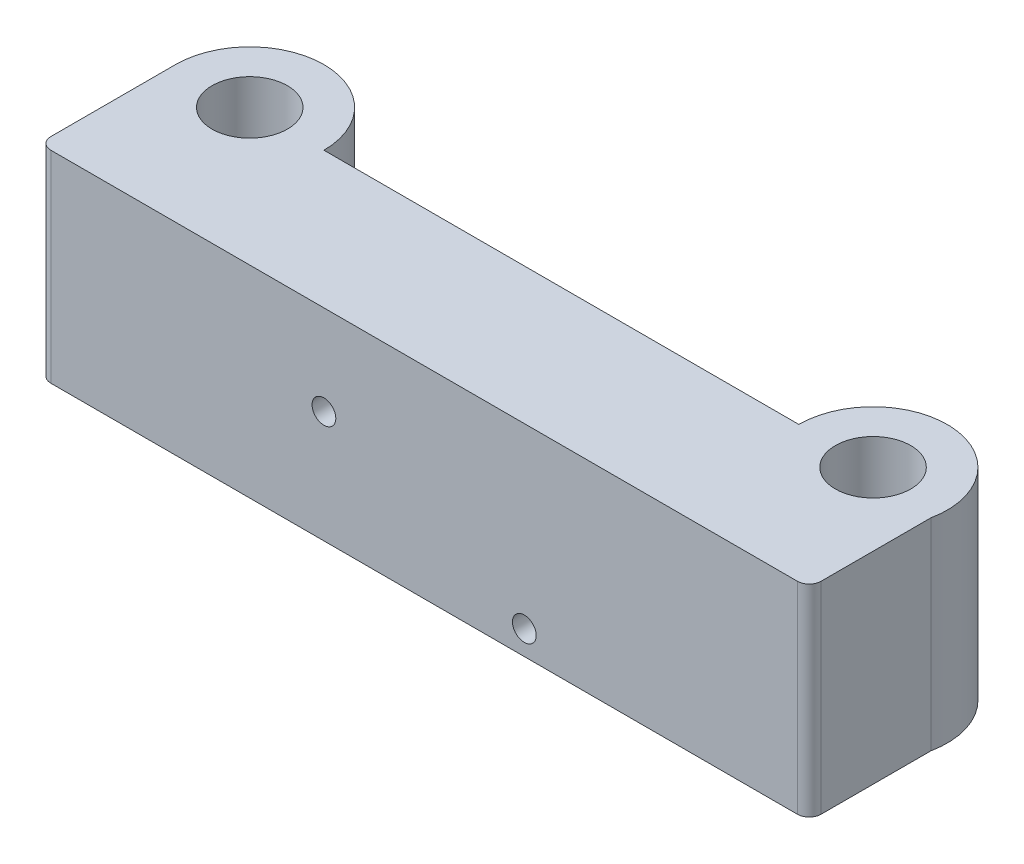
ISO-10303-21;
HEADER;
FILE_DESCRIPTION(('STEP AP214'),'2;1');
FILE_NAME('part.step','',(''),(''),'','','');
FILE_SCHEMA(('AUTOMOTIVE_DESIGN { 1 0 10303 214 1 1 1 1 }'));
ENDSEC;
DATA;
#1=APPLICATION_CONTEXT('core data for automotive mechanical design processes');
#2=APPLICATION_PROTOCOL_DEFINITION('international standard','automotive_design',2000,#1);
#3=PRODUCT_CONTEXT('',#1,'mechanical');
#4=PRODUCT('Part','Part','',(#3));
#5=PRODUCT_RELATED_PRODUCT_CATEGORY('part','',(#4));
#6=PRODUCT_DEFINITION_FORMATION('','',#4);
#7=PRODUCT_DEFINITION_CONTEXT('part definition',#1,'design');
#8=PRODUCT_DEFINITION('design','',#6,#7);
#9=PRODUCT_DEFINITION_SHAPE('','',#8);
#10=(LENGTH_UNIT() NAMED_UNIT(*) SI_UNIT(.MILLI.,.METRE.));
#11=(NAMED_UNIT(*) PLANE_ANGLE_UNIT() SI_UNIT($,.RADIAN.));
#12=(NAMED_UNIT(*) SI_UNIT($,.STERADIAN.) SOLID_ANGLE_UNIT());
#13=UNCERTAINTY_MEASURE_WITH_UNIT(LENGTH_MEASURE(1.E-05),#10,'distance_accuracy_value','');
#14=(GEOMETRIC_REPRESENTATION_CONTEXT(3) GLOBAL_UNCERTAINTY_ASSIGNED_CONTEXT((#13)) GLOBAL_UNIT_ASSIGNED_CONTEXT((#10,
#11,#12)) REPRESENTATION_CONTEXT('',''));
#15=CARTESIAN_POINT('',(0.,0.,0.));
#16=DIRECTION('',(0.,0.,1.));
#17=DIRECTION('',(1.,0.,0.));
#18=AXIS2_PLACEMENT_3D('',#15,#16,#17);
#19=CARTESIAN_POINT('',(-31.235807588018,17.,0.));
#20=DIRECTION('',(0.,-1.,0.));
#21=DIRECTION('',(0.,0.,-1.));
#22=AXIS2_PLACEMENT_3D('',#19,#20,#21);
#23=CYLINDRICAL_SURFACE('',#22,6.25);
#24=CARTESIAN_POINT('',(-31.235807588018,0.,0.));
#25=DIRECTION('',(0.,1.,0.));
#26=DIRECTION('',(0.,0.,1.));
#27=AXIS2_PLACEMENT_3D('',#24,#25,#26);
#28=CIRCLE('',#27,6.25);
#29=CARTESIAN_POINT('',(-24.985807588018,0.,0.));
#30=VERTEX_POINT('',#29);
#31=CARTESIAN_POINT('',(-37.485807588018,0.,0.));
#32=VERTEX_POINT('',#31);
#33=EDGE_CURVE('E126',#30,#32,#28,.T.);
#34=ORIENTED_EDGE('',*,*,#33,.T.);
#35=DIRECTION('',(0.,-1.,0.));
#36=VECTOR('',#35,1.);
#37=CARTESIAN_POINT('',(-37.485807588018,17.,0.));
#38=LINE('',#37,#36);
#39=CARTESIAN_POINT('',(-37.485807588018,17.,0.));
#40=VERTEX_POINT('',#39);
#41=EDGE_CURVE('E107',#40,#32,#38,.T.);
#42=ORIENTED_EDGE('',*,*,#41,.F.);
#43=CARTESIAN_POINT('',(-31.235807588018,17.,0.));
#44=DIRECTION('',(0.,1.,0.));
#45=DIRECTION('',(0.,0.,1.));
#46=AXIS2_PLACEMENT_3D('',#43,#44,#45);
#47=CIRCLE('',#46,6.25);
#48=CARTESIAN_POINT('',(-24.985807588018,17.,0.));
#49=VERTEX_POINT('',#48);
#50=EDGE_CURVE('E113',#49,#40,#47,.T.);
#51=ORIENTED_EDGE('',*,*,#50,.F.);
#52=DIRECTION('',(0.,-1.,0.));
#53=VECTOR('',#52,1.);
#54=CARTESIAN_POINT('',(-24.985807588018,17.,0.));
#55=LINE('',#54,#53);
#56=EDGE_CURVE('E201',#49,#30,#55,.T.);
#57=ORIENTED_EDGE('',*,*,#56,.T.);
#58=EDGE_LOOP('',(#34,#42,#51,#57));
#59=FACE_BOUND('',#58,.T.);
#60=ADVANCED_FACE('F38',(#59),#23,.T.);
#61=CARTESIAN_POINT('',(-37.485807588018,17.,0.));
#62=DIRECTION('',(1.,0.,0.));
#63=DIRECTION('',(0.,0.,-1.));
#64=AXIS2_PLACEMENT_3D('',#61,#62,#63);
#65=PLANE('',#64);
#66=DIRECTION('',(0.,0.,1.));
#67=VECTOR('',#66,1.);
#68=CARTESIAN_POINT('',(-37.485807588018,0.,0.));
#69=LINE('',#68,#67);
#70=CARTESIAN_POINT('',(-37.485807588018,0.,10.5));
#71=VERTEX_POINT('',#70);
#72=EDGE_CURVE('E188',#32,#71,#69,.T.);
#73=ORIENTED_EDGE('',*,*,#72,.T.);
#74=DIRECTION('',(0.,-1.,0.));
#75=VECTOR('',#74,1.);
#76=CARTESIAN_POINT('',(-37.485807588018,17.,10.5));
#77=LINE('',#76,#75);
#78=CARTESIAN_POINT('',(-37.485807588018,17.,10.5));
#79=VERTEX_POINT('',#78);
#80=EDGE_CURVE('E11',#71,#79,#77,.F.);
#81=ORIENTED_EDGE('',*,*,#80,.T.);
#82=DIRECTION('',(0.,0.,1.));
#83=VECTOR('',#82,1.);
#84=CARTESIAN_POINT('',(-37.485807588018,17.,0.));
#85=LINE('',#84,#83);
#86=EDGE_CURVE('E103',#40,#79,#85,.T.);
#87=ORIENTED_EDGE('',*,*,#86,.F.);
#88=ORIENTED_EDGE('',*,*,#41,.T.);
#89=EDGE_LOOP('',(#73,#81,#87,#88));
#90=FACE_BOUND('',#89,.T.);
#91=ADVANCED_FACE('F105',(#90),#65,.F.);
#92=CARTESIAN_POINT('',(-37.485807588018,17.,11.5));
#93=DIRECTION('',(0.,0.,-1.));
#94=DIRECTION('',(-1.,0.,0.));
#95=AXIS2_PLACEMENT_3D('',#92,#93,#94);
#96=PLANE('',#95);
#97=CARTESIAN_POINT('',(-13.485807588018,9.437,11.5));
#98=DIRECTION('',(0.,0.,1.));
#99=DIRECTION('',(1.,0.,0.));
#100=AXIS2_PLACEMENT_3D('',#97,#98,#99);
#101=CIRCLE('',#100,1.);
#102=CARTESIAN_POINT('',(-12.485807588018,9.437,11.5));
#103=VERTEX_POINT('',#102);
#104=EDGE_CURVE('E146',#103,#103,#101,.T.);
#105=ORIENTED_EDGE('',*,*,#104,.F.);
#106=EDGE_LOOP('',(#105));
#107=FACE_BOUND('',#106,.T.);
#108=CARTESIAN_POINT('',(3.39419241198202,2.037,11.5));
#109=DIRECTION('',(0.,0.,1.));
#110=DIRECTION('',(1.,0.,0.));
#111=AXIS2_PLACEMENT_3D('',#108,#109,#110);
#112=CIRCLE('',#111,1.);
#113=CARTESIAN_POINT('',(4.39419241198202,2.037,11.5));
#114=VERTEX_POINT('',#113);
#115=EDGE_CURVE('E233',#114,#114,#112,.T.);
#116=ORIENTED_EDGE('',*,*,#115,.F.);
#117=EDGE_LOOP('',(#116));
#118=FACE_BOUND('',#117,.T.);
#119=DIRECTION('',(1.,0.,0.));
#120=VECTOR('',#119,1.);
#121=CARTESIAN_POINT('',(-37.485807588018,0.,11.5));
#122=LINE('',#121,#120);
#123=CARTESIAN_POINT('',(-36.485807588018,0.,11.5));
#124=VERTEX_POINT('',#123);
#125=CARTESIAN_POINT('',(26.394192411982,0.,11.5));
#126=VERTEX_POINT('',#125);
#127=EDGE_CURVE('E182',#124,#126,#122,.T.);
#128=ORIENTED_EDGE('',*,*,#127,.T.);
#129=DIRECTION('',(0.,-1.,0.));
#130=VECTOR('',#129,1.);
#131=CARTESIAN_POINT('',(26.394192411982,17.,11.5));
#132=LINE('',#131,#130);
#133=CARTESIAN_POINT('',(26.394192411982,17.,11.5));
#134=VERTEX_POINT('',#133);
#135=EDGE_CURVE('E60',#126,#134,#132,.F.);
#136=ORIENTED_EDGE('',*,*,#135,.T.);
#137=DIRECTION('',(1.,0.,0.));
#138=VECTOR('',#137,1.);
#139=CARTESIAN_POINT('',(-37.485807588018,17.,11.5));
#140=LINE('',#139,#138);
#141=CARTESIAN_POINT('',(-36.485807588018,17.,11.5));
#142=VERTEX_POINT('',#141);
#143=EDGE_CURVE('E112',#142,#134,#140,.T.);
#144=ORIENTED_EDGE('',*,*,#143,.F.);
#145=DIRECTION('',(0.,-1.,0.));
#146=VECTOR('',#145,1.);
#147=CARTESIAN_POINT('',(-36.485807588018,17.,11.5));
#148=LINE('',#147,#146);
#149=EDGE_CURVE('E156',#142,#124,#148,.T.);
#150=ORIENTED_EDGE('',*,*,#149,.T.);
#151=EDGE_LOOP('',(#128,#136,#144,#150));
#152=FACE_BOUND('',#151,.T.);
#153=ADVANCED_FACE('F185',(#107,#118,#152),#96,.F.);
#154=CARTESIAN_POINT('',(27.394192411982,17.,1.25));
#155=DIRECTION('',(-1.,0.,0.));
#156=DIRECTION('',(0.,0.,1.));
#157=AXIS2_PLACEMENT_3D('',#154,#155,#156);
#158=PLANE('',#157);
#159=DIRECTION('',(0.,0.,-1.));
#160=VECTOR('',#159,1.);
#161=CARTESIAN_POINT('',(27.394192411982,17.,1.25));
#162=LINE('',#161,#160);
#163=CARTESIAN_POINT('',(27.394192411982,17.,10.5));
#164=VERTEX_POINT('',#163);
#165=CARTESIAN_POINT('',(27.394192411982,17.,1.25));
#166=VERTEX_POINT('',#165);
#167=EDGE_CURVE('E167',#164,#166,#162,.T.);
#168=ORIENTED_EDGE('',*,*,#167,.F.);
#169=DIRECTION('',(0.,-1.,0.));
#170=VECTOR('',#169,1.);
#171=CARTESIAN_POINT('',(27.394192411982,17.,10.5));
#172=LINE('',#171,#170);
#173=CARTESIAN_POINT('',(27.394192411982,0.,10.5));
#174=VERTEX_POINT('',#173);
#175=EDGE_CURVE('E128',#164,#174,#172,.T.);
#176=ORIENTED_EDGE('',*,*,#175,.T.);
#177=DIRECTION('',(0.,0.,-1.));
#178=VECTOR('',#177,1.);
#179=CARTESIAN_POINT('',(27.394192411982,0.,1.25));
#180=LINE('',#179,#178);
#181=CARTESIAN_POINT('',(27.394192411982,0.,1.25));
#182=VERTEX_POINT('',#181);
#183=EDGE_CURVE('E184',#174,#182,#180,.T.);
#184=ORIENTED_EDGE('',*,*,#183,.T.);
#185=DIRECTION('',(0.,-1.,0.));
#186=VECTOR('',#185,1.);
#187=CARTESIAN_POINT('',(27.394192411982,17.,1.25));
#188=LINE('',#187,#186);
#189=EDGE_CURVE('E129',#166,#182,#188,.T.);
#190=ORIENTED_EDGE('',*,*,#189,.F.);
#191=EDGE_LOOP('',(#168,#176,#184,#190));
#192=FACE_BOUND('',#191,.T.);
#193=ADVANCED_FACE('F172',(#192),#158,.F.);
#194=CARTESIAN_POINT('',(21.2704680550241,17.,0.));
#195=DIRECTION('',(0.,-1.,0.));
#196=DIRECTION('',(0.,0.,-1.));
#197=AXIS2_PLACEMENT_3D('',#194,#195,#196);
#198=CYLINDRICAL_SURFACE('',#197,6.25);
#199=CARTESIAN_POINT('',(21.2704680550241,0.,0.));
#200=DIRECTION('',(0.,1.,0.));
#201=DIRECTION('',(0.,0.,1.));
#202=AXIS2_PLACEMENT_3D('',#199,#200,#201);
#203=CIRCLE('',#202,6.25);
#204=CARTESIAN_POINT('',(15.0204680550241,0.,0.));
#205=VERTEX_POINT('',#204);
#206=EDGE_CURVE('E192',#182,#205,#203,.T.);
#207=ORIENTED_EDGE('',*,*,#206,.T.);
#208=DIRECTION('',(0.,-1.,0.));
#209=VECTOR('',#208,1.);
#210=CARTESIAN_POINT('',(15.0204680550241,17.,0.));
#211=LINE('',#210,#209);
#212=CARTESIAN_POINT('',(15.0204680550241,17.,0.));
#213=VERTEX_POINT('',#212);
#214=EDGE_CURVE('E137',#213,#205,#211,.T.);
#215=ORIENTED_EDGE('',*,*,#214,.F.);
#216=CARTESIAN_POINT('',(21.2704680550241,17.,0.));
#217=DIRECTION('',(0.,1.,0.));
#218=DIRECTION('',(0.,0.,1.));
#219=AXIS2_PLACEMENT_3D('',#216,#217,#218);
#220=CIRCLE('',#219,6.25);
#221=EDGE_CURVE('E176',#166,#213,#220,.T.);
#222=ORIENTED_EDGE('',*,*,#221,.F.);
#223=ORIENTED_EDGE('',*,*,#189,.T.);
#224=EDGE_LOOP('',(#207,#215,#222,#223));
#225=FACE_BOUND('',#224,.T.);
#226=ADVANCED_FACE('F257',(#225),#198,.T.);
#227=CARTESIAN_POINT('',(-24.985807588018,17.,0.));
#228=DIRECTION('',(0.,0.,1.));
#229=DIRECTION('',(1.,0.,0.));
#230=AXIS2_PLACEMENT_3D('',#227,#228,#229);
#231=PLANE('',#230);
#232=CARTESIAN_POINT('',(-13.485807588018,9.437,0.));
#233=DIRECTION('',(0.,0.,1.));
#234=DIRECTION('',(1.,0.,0.));
#235=AXIS2_PLACEMENT_3D('',#232,#233,#234);
#236=CIRCLE('',#235,1.);
#237=CARTESIAN_POINT('',(-12.485807588018,9.437,0.));
#238=VERTEX_POINT('',#237);
#239=EDGE_CURVE('E145',#238,#238,#236,.T.);
#240=ORIENTED_EDGE('',*,*,#239,.T.);
#241=EDGE_LOOP('',(#240));
#242=FACE_BOUND('',#241,.T.);
#243=CARTESIAN_POINT('',(3.39419241198202,2.037,0.));
#244=DIRECTION('',(0.,0.,1.));
#245=DIRECTION('',(1.,0.,0.));
#246=AXIS2_PLACEMENT_3D('',#243,#244,#245);
#247=CIRCLE('',#246,1.);
#248=CARTESIAN_POINT('',(4.39419241198202,2.037,0.));
#249=VERTEX_POINT('',#248);
#250=EDGE_CURVE('E141',#249,#249,#247,.T.);
#251=ORIENTED_EDGE('',*,*,#250,.T.);
#252=EDGE_LOOP('',(#251));
#253=FACE_BOUND('',#252,.T.);
#254=DIRECTION('',(-1.,0.,0.));
#255=VECTOR('',#254,1.);
#256=CARTESIAN_POINT('',(-24.985807588018,0.,0.));
#257=LINE('',#256,#255);
#258=EDGE_CURVE('E123',#205,#30,#257,.T.);
#259=ORIENTED_EDGE('',*,*,#258,.T.);
#260=ORIENTED_EDGE('',*,*,#56,.F.);
#261=DIRECTION('',(-1.,0.,0.));
#262=VECTOR('',#261,1.);
#263=CARTESIAN_POINT('',(-24.985807588018,17.,0.));
#264=LINE('',#263,#262);
#265=EDGE_CURVE('E118',#213,#49,#264,.T.);
#266=ORIENTED_EDGE('',*,*,#265,.F.);
#267=ORIENTED_EDGE('',*,*,#214,.T.);
#268=EDGE_LOOP('',(#259,#260,#266,#267));
#269=FACE_BOUND('',#268,.T.);
#270=ADVANCED_FACE('F208',(#242,#253,#269),#231,.F.);
#271=CARTESIAN_POINT('',(-31.235807588018,17.,0.));
#272=DIRECTION('',(0.,1.,0.));
#273=DIRECTION('',(0.,0.,1.));
#274=AXIS2_PLACEMENT_3D('',#271,#272,#273);
#275=PLANE('',#274);
#276=CARTESIAN_POINT('',(-31.235807588018,17.,0.));
#277=DIRECTION('',(0.,1.,0.));
#278=DIRECTION('',(0.,0.,1.));
#279=AXIS2_PLACEMENT_3D('',#276,#277,#278);
#280=CIRCLE('',#279,3.175);
#281=CARTESIAN_POINT('',(-31.235807588018,17.,3.175));
#282=VERTEX_POINT('',#281);
#283=EDGE_CURVE('E214',#282,#282,#280,.T.);
#284=ORIENTED_EDGE('',*,*,#283,.F.);
#285=EDGE_LOOP('',(#284));
#286=FACE_BOUND('',#285,.T.);
#287=CARTESIAN_POINT('',(21.2704680550241,17.,0.));
#288=DIRECTION('',(0.,1.,0.));
#289=DIRECTION('',(0.,0.,1.));
#290=AXIS2_PLACEMENT_3D('',#287,#288,#289);
#291=CIRCLE('',#290,3.175);
#292=CARTESIAN_POINT('',(21.2704680550241,17.,3.175));
#293=VERTEX_POINT('',#292);
#294=EDGE_CURVE('E149',#293,#293,#291,.T.);
#295=ORIENTED_EDGE('',*,*,#294,.F.);
#296=EDGE_LOOP('',(#295));
#297=FACE_BOUND('',#296,.T.);
#298=ORIENTED_EDGE('',*,*,#143,.T.);
#299=CARTESIAN_POINT('',(26.394192411982,17.,10.5));
#300=DIRECTION('',(0.,1.,0.));
#301=DIRECTION('',(0.,0.,1.));
#302=AXIS2_PLACEMENT_3D('',#299,#300,#301);
#303=CIRCLE('',#302,1.);
#304=EDGE_CURVE('E47',#134,#164,#303,.T.);
#305=ORIENTED_EDGE('',*,*,#304,.T.);
#306=ORIENTED_EDGE('',*,*,#167,.T.);
#307=ORIENTED_EDGE('',*,*,#221,.T.);
#308=ORIENTED_EDGE('',*,*,#265,.T.);
#309=ORIENTED_EDGE('',*,*,#50,.T.);
#310=ORIENTED_EDGE('',*,*,#86,.T.);
#311=CARTESIAN_POINT('',(-36.485807588018,17.,10.5));
#312=DIRECTION('',(0.,1.,0.));
#313=DIRECTION('',(0.,0.,1.));
#314=AXIS2_PLACEMENT_3D('',#311,#312,#313);
#315=CIRCLE('',#314,1.);
#316=EDGE_CURVE('E162',#79,#142,#315,.T.);
#317=ORIENTED_EDGE('',*,*,#316,.T.);
#318=EDGE_LOOP('',(#298,#305,#306,#307,#308,#309,#310,#317));
#319=FACE_BOUND('',#318,.T.);
#320=ADVANCED_FACE('F116',(#286,#297,#319),#275,.T.);
#321=CARTESIAN_POINT('',(-31.235807588018,0.,0.));
#322=DIRECTION('',(0.,1.,0.));
#323=DIRECTION('',(0.,0.,1.));
#324=AXIS2_PLACEMENT_3D('',#321,#322,#323);
#325=PLANE('',#324);
#326=CARTESIAN_POINT('',(-31.235807588018,0.,0.));
#327=DIRECTION('',(0.,1.,0.));
#328=DIRECTION('',(0.,0.,1.));
#329=AXIS2_PLACEMENT_3D('',#326,#327,#328);
#330=CIRCLE('',#329,3.175);
#331=CARTESIAN_POINT('',(-31.235807588018,0.,3.175));
#332=VERTEX_POINT('',#331);
#333=EDGE_CURVE('E211',#332,#332,#330,.T.);
#334=ORIENTED_EDGE('',*,*,#333,.T.);
#335=EDGE_LOOP('',(#334));
#336=FACE_BOUND('',#335,.T.);
#337=CARTESIAN_POINT('',(21.2704680550241,0.,0.));
#338=DIRECTION('',(0.,1.,0.));
#339=DIRECTION('',(0.,0.,1.));
#340=AXIS2_PLACEMENT_3D('',#337,#338,#339);
#341=CIRCLE('',#340,3.175);
#342=CARTESIAN_POINT('',(21.2704680550241,0.,3.175));
#343=VERTEX_POINT('',#342);
#344=EDGE_CURVE('E226',#343,#343,#341,.T.);
#345=ORIENTED_EDGE('',*,*,#344,.T.);
#346=EDGE_LOOP('',(#345));
#347=FACE_BOUND('',#346,.T.);
#348=ORIENTED_EDGE('',*,*,#183,.F.);
#349=CARTESIAN_POINT('',(26.394192411982,0.,10.5));
#350=DIRECTION('',(0.,1.,0.));
#351=DIRECTION('',(0.,0.,1.));
#352=AXIS2_PLACEMENT_3D('',#349,#350,#351);
#353=CIRCLE('',#352,1.);
#354=EDGE_CURVE('E153',#174,#126,#353,.F.);
#355=ORIENTED_EDGE('',*,*,#354,.T.);
#356=ORIENTED_EDGE('',*,*,#127,.F.);
#357=CARTESIAN_POINT('',(-36.485807588018,0.,10.5));
#358=DIRECTION('',(0.,1.,0.));
#359=DIRECTION('',(0.,0.,1.));
#360=AXIS2_PLACEMENT_3D('',#357,#358,#359);
#361=CIRCLE('',#360,1.);
#362=EDGE_CURVE('E134',#124,#71,#361,.F.);
#363=ORIENTED_EDGE('',*,*,#362,.T.);
#364=ORIENTED_EDGE('',*,*,#72,.F.);
#365=ORIENTED_EDGE('',*,*,#33,.F.);
#366=ORIENTED_EDGE('',*,*,#258,.F.);
#367=ORIENTED_EDGE('',*,*,#206,.F.);
#368=EDGE_LOOP('',(#348,#355,#356,#363,#364,#365,#366,#367));
#369=FACE_BOUND('',#368,.T.);
#370=ADVANCED_FACE('F181',(#336,#347,#369),#325,.F.);
#371=CARTESIAN_POINT('',(21.2704680550241,0.,0.));
#372=DIRECTION('',(0.,1.,0.));
#373=DIRECTION('',(0.,0.,1.));
#374=AXIS2_PLACEMENT_3D('',#371,#372,#373);
#375=CYLINDRICAL_SURFACE('',#374,3.175);
#376=ORIENTED_EDGE('',*,*,#344,.F.);
#377=EDGE_LOOP('',(#376));
#378=FACE_BOUND('',#377,.T.);
#379=ORIENTED_EDGE('',*,*,#294,.T.);
#380=EDGE_LOOP('',(#379));
#381=FACE_BOUND('',#380,.T.);
#382=ADVANCED_FACE('F288',(#378,#381),#375,.F.);
#383=CARTESIAN_POINT('',(-31.235807588018,0.,0.));
#384=DIRECTION('',(0.,1.,0.));
#385=DIRECTION('',(0.,0.,1.));
#386=AXIS2_PLACEMENT_3D('',#383,#384,#385);
#387=CYLINDRICAL_SURFACE('',#386,3.175);
#388=ORIENTED_EDGE('',*,*,#333,.F.);
#389=EDGE_LOOP('',(#388));
#390=FACE_BOUND('',#389,.T.);
#391=ORIENTED_EDGE('',*,*,#283,.T.);
#392=EDGE_LOOP('',(#391));
#393=FACE_BOUND('',#392,.T.);
#394=ADVANCED_FACE('F252',(#390,#393),#387,.F.);
#395=CARTESIAN_POINT('',(3.39419241198202,2.037,-6.25));
#396=DIRECTION('',(0.,0.,1.));
#397=DIRECTION('',(1.,0.,0.));
#398=AXIS2_PLACEMENT_3D('',#395,#396,#397);
#399=CYLINDRICAL_SURFACE('',#398,1.);
#400=ORIENTED_EDGE('',*,*,#115,.T.);
#401=EDGE_LOOP('',(#400));
#402=FACE_BOUND('',#401,.T.);
#403=ORIENTED_EDGE('',*,*,#250,.F.);
#404=EDGE_LOOP('',(#403));
#405=FACE_BOUND('',#404,.T.);
#406=ADVANCED_FACE('F249',(#402,#405),#399,.F.);
#407=CARTESIAN_POINT('',(-13.485807588018,9.437,-6.25));
#408=DIRECTION('',(0.,0.,1.));
#409=DIRECTION('',(1.,0.,0.));
#410=AXIS2_PLACEMENT_3D('',#407,#408,#409);
#411=CYLINDRICAL_SURFACE('',#410,1.);
#412=ORIENTED_EDGE('',*,*,#104,.T.);
#413=EDGE_LOOP('',(#412));
#414=FACE_BOUND('',#413,.T.);
#415=ORIENTED_EDGE('',*,*,#239,.F.);
#416=EDGE_LOOP('',(#415));
#417=FACE_BOUND('',#416,.T.);
#418=ADVANCED_FACE('F241',(#414,#417),#411,.F.);
#419=CARTESIAN_POINT('',(26.394192411982,17.,10.5));
#420=DIRECTION('',(0.,-1.,0.));
#421=DIRECTION('',(0.,0.,-1.));
#422=AXIS2_PLACEMENT_3D('',#419,#420,#421);
#423=CYLINDRICAL_SURFACE('',#422,1.);
#424=ORIENTED_EDGE('',*,*,#304,.F.);
#425=ORIENTED_EDGE('',*,*,#135,.F.);
#426=ORIENTED_EDGE('',*,*,#354,.F.);
#427=ORIENTED_EDGE('',*,*,#175,.F.);
#428=EDGE_LOOP('',(#424,#425,#426,#427));
#429=FACE_BOUND('',#428,.T.);
#430=ADVANCED_FACE('F178',(#429),#423,.T.);
#431=CARTESIAN_POINT('',(-36.485807588018,17.,10.5));
#432=DIRECTION('',(0.,-1.,0.));
#433=DIRECTION('',(0.,0.,-1.));
#434=AXIS2_PLACEMENT_3D('',#431,#432,#433);
#435=CYLINDRICAL_SURFACE('',#434,1.);
#436=ORIENTED_EDGE('',*,*,#316,.F.);
#437=ORIENTED_EDGE('',*,*,#80,.F.);
#438=ORIENTED_EDGE('',*,*,#362,.F.);
#439=ORIENTED_EDGE('',*,*,#149,.F.);
#440=EDGE_LOOP('',(#436,#437,#438,#439));
#441=FACE_BOUND('',#440,.T.);
#442=ADVANCED_FACE('F40',(#441),#435,.T.);
#443=CLOSED_SHELL('',(#60,#91,#153,#193,#226,#270,#320,#370,#382,#394,#406,#418,#430,#442));
#444=MANIFOLD_SOLID_BREP('B2',#443);
#445=ADVANCED_BREP_SHAPE_REPRESENTATION('',(#18,#444),#14);
#446=SHAPE_DEFINITION_REPRESENTATION(#9,#445);
ENDSEC;
END-ISO-10303-21;
